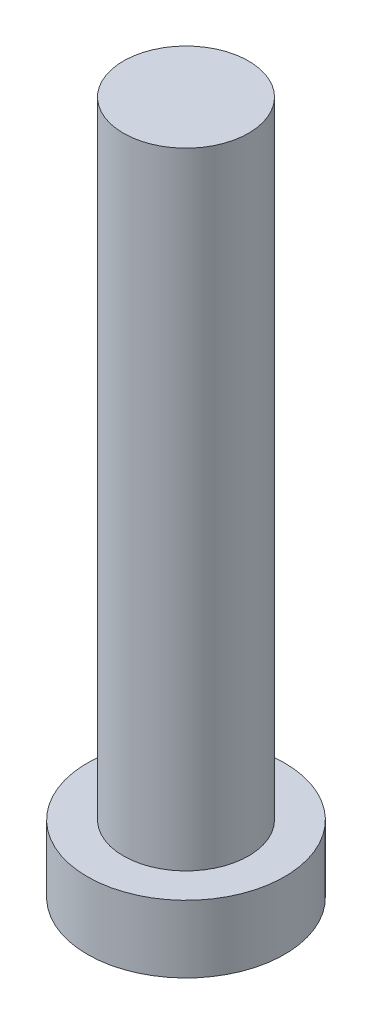
ISO-10303-21;
HEADER;
FILE_DESCRIPTION(('STEP AP214'),'2;1');
FILE_NAME('part.step','',(''),(''),'','','');
FILE_SCHEMA(('AUTOMOTIVE_DESIGN { 1 0 10303 214 1 1 1 1 }'));
ENDSEC;
DATA;
#1=APPLICATION_CONTEXT('core data for automotive mechanical design processes');
#2=APPLICATION_PROTOCOL_DEFINITION('international standard','automotive_design',2000,#1);
#3=PRODUCT_CONTEXT('',#1,'mechanical');
#4=PRODUCT('Part','Part','',(#3));
#5=PRODUCT_RELATED_PRODUCT_CATEGORY('part','',(#4));
#6=PRODUCT_DEFINITION_FORMATION('','',#4);
#7=PRODUCT_DEFINITION_CONTEXT('part definition',#1,'design');
#8=PRODUCT_DEFINITION('design','',#6,#7);
#9=PRODUCT_DEFINITION_SHAPE('','',#8);
#10=(LENGTH_UNIT() NAMED_UNIT(*) SI_UNIT(.MILLI.,.METRE.));
#11=(NAMED_UNIT(*) PLANE_ANGLE_UNIT() SI_UNIT($,.RADIAN.));
#12=(NAMED_UNIT(*) SI_UNIT($,.STERADIAN.) SOLID_ANGLE_UNIT());
#13=UNCERTAINTY_MEASURE_WITH_UNIT(LENGTH_MEASURE(1.E-05),#10,'distance_accuracy_value','');
#14=(GEOMETRIC_REPRESENTATION_CONTEXT(3) GLOBAL_UNCERTAINTY_ASSIGNED_CONTEXT((#13)) GLOBAL_UNIT_ASSIGNED_CONTEXT((#10,
#11,#12)) REPRESENTATION_CONTEXT('',''));
#15=CARTESIAN_POINT('',(0.,0.,0.));
#16=DIRECTION('',(0.,0.,1.));
#17=DIRECTION('',(1.,0.,0.));
#18=AXIS2_PLACEMENT_3D('',#15,#16,#17);
#19=CARTESIAN_POINT('',(0.,0.,0.));
#20=DIRECTION('',(0.,1.,0.));
#21=DIRECTION('',(0.,0.,1.));
#22=AXIS2_PLACEMENT_3D('',#19,#20,#21);
#23=PLANE('',#22);
#24=CARTESIAN_POINT('',(0.,0.,0.));
#25=DIRECTION('',(0.,1.,0.));
#26=DIRECTION('',(0.,0.,1.));
#27=AXIS2_PLACEMENT_3D('',#24,#25,#26);
#28=CIRCLE('',#27,3.15);
#29=CARTESIAN_POINT('',(0.,0.,3.15));
#30=VERTEX_POINT('',#29);
#31=EDGE_CURVE('E39',#30,#30,#28,.T.);
#32=ORIENTED_EDGE('',*,*,#31,.F.);
#33=EDGE_LOOP('',(#32));
#34=FACE_BOUND('',#33,.T.);
#35=CARTESIAN_POINT('',(1.,0.,1.));
#36=DIRECTION('',(0.,1.,0.));
#37=DIRECTION('',(0.,0.,-1.));
#38=AXIS2_PLACEMENT_3D('',#35,#36,#37);
#39=CIRCLE('',#38,0.5);
#40=CARTESIAN_POINT('',(1.,0.,0.5));
#41=VERTEX_POINT('',#40);
#42=CARTESIAN_POINT('',(0.5,0.,1.));
#43=VERTEX_POINT('',#42);
#44=EDGE_CURVE('E186',#41,#43,#39,.T.);
#45=ORIENTED_EDGE('',*,*,#44,.F.);
#46=DIRECTION('',(-1.,0.,0.));
#47=VECTOR('',#46,1.);
#48=CARTESIAN_POINT('',(1.,0.,0.5));
#49=LINE('',#48,#47);
#50=CARTESIAN_POINT('',(2.,0.,0.5));
#51=VERTEX_POINT('',#50);
#52=EDGE_CURVE('E52',#51,#41,#49,.T.);
#53=ORIENTED_EDGE('',*,*,#52,.F.);
#54=DIRECTION('',(0.,0.,1.));
#55=VECTOR('',#54,1.);
#56=CARTESIAN_POINT('',(2.,0.,-0.5));
#57=LINE('',#56,#55);
#58=CARTESIAN_POINT('',(2.,0.,-0.5));
#59=VERTEX_POINT('',#58);
#60=EDGE_CURVE('E225',#59,#51,#57,.T.);
#61=ORIENTED_EDGE('',*,*,#60,.F.);
#62=DIRECTION('',(1.,0.,0.));
#63=VECTOR('',#62,1.);
#64=CARTESIAN_POINT('',(1.,0.,-0.5));
#65=LINE('',#64,#63);
#66=CARTESIAN_POINT('',(1.,0.,-0.5));
#67=VERTEX_POINT('',#66);
#68=EDGE_CURVE('E223',#67,#59,#65,.T.);
#69=ORIENTED_EDGE('',*,*,#68,.F.);
#70=CARTESIAN_POINT('',(1.,0.,-1.));
#71=DIRECTION('',(0.,1.,0.));
#72=DIRECTION('',(0.,0.,-1.));
#73=AXIS2_PLACEMENT_3D('',#70,#71,#72);
#74=CIRCLE('',#73,0.5);
#75=CARTESIAN_POINT('',(0.500000000000001,0.,-1.));
#76=VERTEX_POINT('',#75);
#77=EDGE_CURVE('E160',#76,#67,#74,.T.);
#78=ORIENTED_EDGE('',*,*,#77,.F.);
#79=DIRECTION('',(0.,0.,1.));
#80=VECTOR('',#79,1.);
#81=CARTESIAN_POINT('',(0.500000000000001,0.,-2.));
#82=LINE('',#81,#80);
#83=CARTESIAN_POINT('',(0.500000000000001,0.,-2.));
#84=VERTEX_POINT('',#83);
#85=EDGE_CURVE('E219',#84,#76,#82,.T.);
#86=ORIENTED_EDGE('',*,*,#85,.F.);
#87=DIRECTION('',(1.,0.,0.));
#88=VECTOR('',#87,1.);
#89=CARTESIAN_POINT('',(-0.5,0.,-2.));
#90=LINE('',#89,#88);
#91=CARTESIAN_POINT('',(-0.5,0.,-2.));
#92=VERTEX_POINT('',#91);
#93=EDGE_CURVE('E216',#92,#84,#90,.T.);
#94=ORIENTED_EDGE('',*,*,#93,.F.);
#95=DIRECTION('',(0.,0.,-1.));
#96=VECTOR('',#95,1.);
#97=CARTESIAN_POINT('',(-0.5,0.,-2.));
#98=LINE('',#97,#96);
#99=CARTESIAN_POINT('',(-0.5,0.,-1.));
#100=VERTEX_POINT('',#99);
#101=EDGE_CURVE('E213',#100,#92,#98,.T.);
#102=ORIENTED_EDGE('',*,*,#101,.F.);
#103=CARTESIAN_POINT('',(-1.,0.,-1.));
#104=DIRECTION('',(0.,1.,0.));
#105=DIRECTION('',(0.,0.,-1.));
#106=AXIS2_PLACEMENT_3D('',#103,#104,#105);
#107=CIRCLE('',#106,0.5);
#108=CARTESIAN_POINT('',(-1.,0.,-0.5));
#109=VERTEX_POINT('',#108);
#110=EDGE_CURVE('E210',#109,#100,#107,.T.);
#111=ORIENTED_EDGE('',*,*,#110,.F.);
#112=DIRECTION('',(1.,0.,0.));
#113=VECTOR('',#112,1.);
#114=CARTESIAN_POINT('',(-2.,0.,-0.5));
#115=LINE('',#114,#113);
#116=CARTESIAN_POINT('',(-2.,0.,-0.5));
#117=VERTEX_POINT('',#116);
#118=EDGE_CURVE('E207',#117,#109,#115,.T.);
#119=ORIENTED_EDGE('',*,*,#118,.F.);
#120=DIRECTION('',(0.,0.,-1.));
#121=VECTOR('',#120,1.);
#122=CARTESIAN_POINT('',(-2.,0.,-0.5));
#123=LINE('',#122,#121);
#124=CARTESIAN_POINT('',(-2.,0.,0.5));
#125=VERTEX_POINT('',#124);
#126=EDGE_CURVE('E204',#125,#117,#123,.T.);
#127=ORIENTED_EDGE('',*,*,#126,.F.);
#128=DIRECTION('',(-1.,0.,0.));
#129=VECTOR('',#128,1.);
#130=CARTESIAN_POINT('',(-2.,0.,0.5));
#131=LINE('',#130,#129);
#132=CARTESIAN_POINT('',(-1.,0.,0.5));
#133=VERTEX_POINT('',#132);
#134=EDGE_CURVE('E201',#133,#125,#131,.T.);
#135=ORIENTED_EDGE('',*,*,#134,.F.);
#136=CARTESIAN_POINT('',(-1.,0.,1.));
#137=DIRECTION('',(0.,1.,0.));
#138=DIRECTION('',(0.,0.,1.));
#139=AXIS2_PLACEMENT_3D('',#136,#137,#138);
#140=CIRCLE('',#139,0.5);
#141=CARTESIAN_POINT('',(-0.5,0.,1.));
#142=VERTEX_POINT('',#141);
#143=EDGE_CURVE('E198',#142,#133,#140,.T.);
#144=ORIENTED_EDGE('',*,*,#143,.F.);
#145=DIRECTION('',(0.,0.,-1.));
#146=VECTOR('',#145,1.);
#147=CARTESIAN_POINT('',(-0.5,0.,1.));
#148=LINE('',#147,#146);
#149=CARTESIAN_POINT('',(-0.5,0.,2.));
#150=VERTEX_POINT('',#149);
#151=EDGE_CURVE('E195',#150,#142,#148,.T.);
#152=ORIENTED_EDGE('',*,*,#151,.F.);
#153=DIRECTION('',(-1.,0.,0.));
#154=VECTOR('',#153,1.);
#155=CARTESIAN_POINT('',(-0.5,0.,2.));
#156=LINE('',#155,#154);
#157=CARTESIAN_POINT('',(0.500000000000001,0.,2.));
#158=VERTEX_POINT('',#157);
#159=EDGE_CURVE('E192',#158,#150,#156,.T.);
#160=ORIENTED_EDGE('',*,*,#159,.F.);
#161=DIRECTION('',(0.,0.,1.));
#162=VECTOR('',#161,1.);
#163=CARTESIAN_POINT('',(0.5,0.,1.));
#164=LINE('',#163,#162);
#165=EDGE_CURVE('E189',#43,#158,#164,.T.);
#166=ORIENTED_EDGE('',*,*,#165,.F.);
#167=EDGE_LOOP('',(#45,#53,#61,#69,#78,#86,#94,#102,#111,#119,#127,#135,#144,#152,#160,#166));
#168=FACE_BOUND('',#167,.T.);
#169=ADVANCED_FACE('F35',(#34,#168),#23,.F.);
#170=CARTESIAN_POINT('',(0.,2.15,0.));
#171=DIRECTION('',(0.,-1.,0.));
#172=DIRECTION('',(0.,0.,-1.));
#173=AXIS2_PLACEMENT_3D('',#170,#171,#172);
#174=CYLINDRICAL_SURFACE('',#173,3.15);
#175=CARTESIAN_POINT('',(0.,2.15,0.));
#176=DIRECTION('',(0.,1.,0.));
#177=DIRECTION('',(0.,0.,1.));
#178=AXIS2_PLACEMENT_3D('',#175,#176,#177);
#179=CIRCLE('',#178,3.15);
#180=CARTESIAN_POINT('',(0.,2.15,3.15));
#181=VERTEX_POINT('',#180);
#182=EDGE_CURVE('E44',#181,#181,#179,.T.);
#183=ORIENTED_EDGE('',*,*,#182,.F.);
#184=EDGE_LOOP('',(#183));
#185=FACE_BOUND('',#184,.T.);
#186=ORIENTED_EDGE('',*,*,#31,.T.);
#187=EDGE_LOOP('',(#186));
#188=FACE_BOUND('',#187,.T.);
#189=ADVANCED_FACE('F37',(#185,#188),#174,.T.);
#190=CARTESIAN_POINT('',(0.,2.15,0.));
#191=DIRECTION('',(0.,1.,0.));
#192=DIRECTION('',(0.,0.,1.));
#193=AXIS2_PLACEMENT_3D('',#190,#191,#192);
#194=PLANE('',#193);
#195=CARTESIAN_POINT('',(0.,2.15,0.));
#196=DIRECTION('',(0.,1.,0.));
#197=DIRECTION('',(0.,0.,1.));
#198=AXIS2_PLACEMENT_3D('',#195,#196,#197);
#199=CIRCLE('',#198,2.);
#200=CARTESIAN_POINT('',(0.,2.15,2.));
#201=VERTEX_POINT('',#200);
#202=EDGE_CURVE('E11',#201,#201,#199,.T.);
#203=ORIENTED_EDGE('',*,*,#202,.F.);
#204=EDGE_LOOP('',(#203));
#205=FACE_BOUND('',#204,.T.);
#206=ORIENTED_EDGE('',*,*,#182,.T.);
#207=EDGE_LOOP('',(#206));
#208=FACE_BOUND('',#207,.T.);
#209=ADVANCED_FACE('F374',(#205,#208),#194,.T.);
#210=CARTESIAN_POINT('',(0.,22.15,0.));
#211=DIRECTION('',(0.,-1.,0.));
#212=DIRECTION('',(0.,0.,-1.));
#213=AXIS2_PLACEMENT_3D('',#210,#211,#212);
#214=CYLINDRICAL_SURFACE('',#213,2.);
#215=CARTESIAN_POINT('',(0.,22.15,0.));
#216=DIRECTION('',(0.,1.,0.));
#217=DIRECTION('',(0.,0.,1.));
#218=AXIS2_PLACEMENT_3D('',#215,#216,#217);
#219=CIRCLE('',#218,2.);
#220=CARTESIAN_POINT('',(0.,22.15,2.));
#221=VERTEX_POINT('',#220);
#222=EDGE_CURVE('E229',#221,#221,#219,.T.);
#223=ORIENTED_EDGE('',*,*,#222,.F.);
#224=EDGE_LOOP('',(#223));
#225=FACE_BOUND('',#224,.T.);
#226=ORIENTED_EDGE('',*,*,#202,.T.);
#227=EDGE_LOOP('',(#226));
#228=FACE_BOUND('',#227,.T.);
#229=ADVANCED_FACE('F370',(#225,#228),#214,.T.);
#230=CARTESIAN_POINT('',(0.,22.15,0.));
#231=DIRECTION('',(0.,1.,0.));
#232=DIRECTION('',(0.,0.,1.));
#233=AXIS2_PLACEMENT_3D('',#230,#231,#232);
#234=PLANE('',#233);
#235=ORIENTED_EDGE('',*,*,#222,.T.);
#236=EDGE_LOOP('',(#235));
#237=FACE_BOUND('',#236,.T.);
#238=ADVANCED_FACE('F320',(#237),#234,.T.);
#239=CARTESIAN_POINT('',(1.,1.5,0.5));
#240=DIRECTION('',(0.,0.,1.));
#241=DIRECTION('',(1.,0.,0.));
#242=AXIS2_PLACEMENT_3D('',#239,#240,#241);
#243=PLANE('',#242);
#244=ORIENTED_EDGE('',*,*,#52,.T.);
#245=DIRECTION('',(0.,-1.,0.));
#246=VECTOR('',#245,1.);
#247=CARTESIAN_POINT('',(1.,1.5,0.5));
#248=LINE('',#247,#246);
#249=CARTESIAN_POINT('',(1.,1.5,0.5));
#250=VERTEX_POINT('',#249);
#251=EDGE_CURVE('E112',#250,#41,#248,.T.);
#252=ORIENTED_EDGE('',*,*,#251,.F.);
#253=DIRECTION('',(-1.,0.,0.));
#254=VECTOR('',#253,1.);
#255=CARTESIAN_POINT('',(1.,1.5,0.5));
#256=LINE('',#255,#254);
#257=CARTESIAN_POINT('',(2.,1.5,0.5));
#258=VERTEX_POINT('',#257);
#259=EDGE_CURVE('E227',#258,#250,#256,.T.);
#260=ORIENTED_EDGE('',*,*,#259,.F.);
#261=DIRECTION('',(0.,-1.,0.));
#262=VECTOR('',#261,1.);
#263=CARTESIAN_POINT('',(2.,1.5,0.5));
#264=LINE('',#263,#262);
#265=EDGE_CURVE('E60',#258,#51,#264,.T.);
#266=ORIENTED_EDGE('',*,*,#265,.T.);
#267=EDGE_LOOP('',(#244,#252,#260,#266));
#268=FACE_BOUND('',#267,.T.);
#269=ADVANCED_FACE('F313',(#268),#243,.F.);
#270=CARTESIAN_POINT('',(2.,1.5,-0.5));
#271=DIRECTION('',(1.,0.,0.));
#272=DIRECTION('',(0.,0.,-1.));
#273=AXIS2_PLACEMENT_3D('',#270,#271,#272);
#274=PLANE('',#273);
#275=ORIENTED_EDGE('',*,*,#60,.T.);
#276=ORIENTED_EDGE('',*,*,#265,.F.);
#277=DIRECTION('',(0.,0.,1.));
#278=VECTOR('',#277,1.);
#279=CARTESIAN_POINT('',(2.,1.5,-0.5));
#280=LINE('',#279,#278);
#281=CARTESIAN_POINT('',(2.,1.5,-0.5));
#282=VERTEX_POINT('',#281);
#283=EDGE_CURVE('E172',#282,#258,#280,.T.);
#284=ORIENTED_EDGE('',*,*,#283,.F.);
#285=DIRECTION('',(0.,-1.,0.));
#286=VECTOR('',#285,1.);
#287=CARTESIAN_POINT('',(2.,1.5,-0.5));
#288=LINE('',#287,#286);
#289=EDGE_CURVE('E164',#282,#59,#288,.T.);
#290=ORIENTED_EDGE('',*,*,#289,.T.);
#291=EDGE_LOOP('',(#275,#276,#284,#290));
#292=FACE_BOUND('',#291,.T.);
#293=ADVANCED_FACE('F311',(#292),#274,.F.);
#294=CARTESIAN_POINT('',(1.,1.5,-0.5));
#295=DIRECTION('',(0.,0.,-1.));
#296=DIRECTION('',(-1.,0.,0.));
#297=AXIS2_PLACEMENT_3D('',#294,#295,#296);
#298=PLANE('',#297);
#299=ORIENTED_EDGE('',*,*,#68,.T.);
#300=ORIENTED_EDGE('',*,*,#289,.F.);
#301=DIRECTION('',(1.,0.,0.));
#302=VECTOR('',#301,1.);
#303=CARTESIAN_POINT('',(1.,1.5,-0.5));
#304=LINE('',#303,#302);
#305=CARTESIAN_POINT('',(1.,1.5,-0.5));
#306=VERTEX_POINT('',#305);
#307=EDGE_CURVE('E168',#306,#282,#304,.T.);
#308=ORIENTED_EDGE('',*,*,#307,.F.);
#309=DIRECTION('',(0.,-1.,0.));
#310=VECTOR('',#309,1.);
#311=CARTESIAN_POINT('',(1.,1.5,-0.5));
#312=LINE('',#311,#310);
#313=EDGE_CURVE('E153',#306,#67,#312,.T.);
#314=ORIENTED_EDGE('',*,*,#313,.T.);
#315=EDGE_LOOP('',(#299,#300,#308,#314));
#316=FACE_BOUND('',#315,.T.);
#317=ADVANCED_FACE('F169',(#316),#298,.F.);
#318=CARTESIAN_POINT('',(1.,1.5,-1.));
#319=DIRECTION('',(0.,-1.,0.));
#320=DIRECTION('',(0.,0.,-1.));
#321=AXIS2_PLACEMENT_3D('',#318,#319,#320);
#322=CYLINDRICAL_SURFACE('',#321,0.5);
#323=ORIENTED_EDGE('',*,*,#77,.T.);
#324=ORIENTED_EDGE('',*,*,#313,.F.);
#325=CARTESIAN_POINT('',(1.,1.5,-1.));
#326=DIRECTION('',(0.,1.,0.));
#327=DIRECTION('',(0.,0.,-1.));
#328=AXIS2_PLACEMENT_3D('',#325,#326,#327);
#329=CIRCLE('',#328,0.5);
#330=CARTESIAN_POINT('',(0.500000000000001,1.5,-1.));
#331=VERTEX_POINT('',#330);
#332=EDGE_CURVE('E157',#331,#306,#329,.T.);
#333=ORIENTED_EDGE('',*,*,#332,.F.);
#334=DIRECTION('',(0.,-1.,0.));
#335=VECTOR('',#334,1.);
#336=CARTESIAN_POINT('',(0.500000000000001,1.5,-1.));
#337=LINE('',#336,#335);
#338=EDGE_CURVE('E165',#331,#76,#337,.T.);
#339=ORIENTED_EDGE('',*,*,#338,.T.);
#340=EDGE_LOOP('',(#323,#324,#333,#339));
#341=FACE_BOUND('',#340,.T.);
#342=ADVANCED_FACE('F155',(#341),#322,.T.);
#343=CARTESIAN_POINT('',(0.500000000000001,1.5,-2.));
#344=DIRECTION('',(1.,0.,0.));
#345=DIRECTION('',(0.,0.,-1.));
#346=AXIS2_PLACEMENT_3D('',#343,#344,#345);
#347=PLANE('',#346);
#348=ORIENTED_EDGE('',*,*,#85,.T.);
#349=ORIENTED_EDGE('',*,*,#338,.F.);
#350=DIRECTION('',(0.,0.,1.));
#351=VECTOR('',#350,1.);
#352=CARTESIAN_POINT('',(0.500000000000001,1.5,-2.));
#353=LINE('',#352,#351);
#354=CARTESIAN_POINT('',(0.500000000000001,1.5,-2.));
#355=VERTEX_POINT('',#354);
#356=EDGE_CURVE('E178',#355,#331,#353,.T.);
#357=ORIENTED_EDGE('',*,*,#356,.F.);
#358=DIRECTION('',(0.,-1.,0.));
#359=VECTOR('',#358,1.);
#360=CARTESIAN_POINT('',(0.500000000000001,1.5,-2.));
#361=LINE('',#360,#359);
#362=EDGE_CURVE('E232',#355,#84,#361,.T.);
#363=ORIENTED_EDGE('',*,*,#362,.T.);
#364=EDGE_LOOP('',(#348,#349,#357,#363));
#365=FACE_BOUND('',#364,.T.);
#366=ADVANCED_FACE('F310',(#365),#347,.F.);
#367=CARTESIAN_POINT('',(-0.5,1.5,-2.));
#368=DIRECTION('',(0.,0.,-1.));
#369=DIRECTION('',(-1.,0.,0.));
#370=AXIS2_PLACEMENT_3D('',#367,#368,#369);
#371=PLANE('',#370);
#372=ORIENTED_EDGE('',*,*,#93,.T.);
#373=ORIENTED_EDGE('',*,*,#362,.F.);
#374=DIRECTION('',(1.,0.,0.));
#375=VECTOR('',#374,1.);
#376=CARTESIAN_POINT('',(-0.5,1.5,-2.));
#377=LINE('',#376,#375);
#378=CARTESIAN_POINT('',(-0.5,1.5,-2.));
#379=VERTEX_POINT('',#378);
#380=EDGE_CURVE('E180',#379,#355,#377,.T.);
#381=ORIENTED_EDGE('',*,*,#380,.F.);
#382=DIRECTION('',(0.,-1.,0.));
#383=VECTOR('',#382,1.);
#384=CARTESIAN_POINT('',(-0.5,1.5,-2.));
#385=LINE('',#384,#383);
#386=EDGE_CURVE('E234',#379,#92,#385,.T.);
#387=ORIENTED_EDGE('',*,*,#386,.T.);
#388=EDGE_LOOP('',(#372,#373,#381,#387));
#389=FACE_BOUND('',#388,.T.);
#390=ADVANCED_FACE('F306',(#389),#371,.F.);
#391=CARTESIAN_POINT('',(-0.5,1.5,-2.));
#392=DIRECTION('',(-1.,0.,0.));
#393=DIRECTION('',(0.,0.,1.));
#394=AXIS2_PLACEMENT_3D('',#391,#392,#393);
#395=PLANE('',#394);
#396=ORIENTED_EDGE('',*,*,#101,.T.);
#397=ORIENTED_EDGE('',*,*,#386,.F.);
#398=DIRECTION('',(0.,0.,-1.));
#399=VECTOR('',#398,1.);
#400=CARTESIAN_POINT('',(-0.5,1.5,-2.));
#401=LINE('',#400,#399);
#402=CARTESIAN_POINT('',(-0.5,1.5,-1.));
#403=VERTEX_POINT('',#402);
#404=EDGE_CURVE('E301',#403,#379,#401,.T.);
#405=ORIENTED_EDGE('',*,*,#404,.F.);
#406=DIRECTION('',(0.,-1.,0.));
#407=VECTOR('',#406,1.);
#408=CARTESIAN_POINT('',(-0.5,1.5,-1.));
#409=LINE('',#408,#407);
#410=EDGE_CURVE('E236',#403,#100,#409,.T.);
#411=ORIENTED_EDGE('',*,*,#410,.T.);
#412=EDGE_LOOP('',(#396,#397,#405,#411));
#413=FACE_BOUND('',#412,.T.);
#414=ADVANCED_FACE('F330',(#413),#395,.F.);
#415=CARTESIAN_POINT('',(-1.,1.5,-1.));
#416=DIRECTION('',(0.,-1.,0.));
#417=DIRECTION('',(0.,0.,-1.));
#418=AXIS2_PLACEMENT_3D('',#415,#416,#417);
#419=CYLINDRICAL_SURFACE('',#418,0.5);
#420=ORIENTED_EDGE('',*,*,#110,.T.);
#421=ORIENTED_EDGE('',*,*,#410,.F.);
#422=CARTESIAN_POINT('',(-1.,1.5,-1.));
#423=DIRECTION('',(0.,1.,0.));
#424=DIRECTION('',(0.,0.,-1.));
#425=AXIS2_PLACEMENT_3D('',#422,#423,#424);
#426=CIRCLE('',#425,0.5);
#427=CARTESIAN_POINT('',(-1.,1.5,-0.5));
#428=VERTEX_POINT('',#427);
#429=EDGE_CURVE('E298',#428,#403,#426,.T.);
#430=ORIENTED_EDGE('',*,*,#429,.F.);
#431=DIRECTION('',(0.,-1.,0.));
#432=VECTOR('',#431,1.);
#433=CARTESIAN_POINT('',(-1.,1.5,-0.5));
#434=LINE('',#433,#432);
#435=EDGE_CURVE('E238',#428,#109,#434,.T.);
#436=ORIENTED_EDGE('',*,*,#435,.T.);
#437=EDGE_LOOP('',(#420,#421,#430,#436));
#438=FACE_BOUND('',#437,.T.);
#439=ADVANCED_FACE('F333',(#438),#419,.T.);
#440=CARTESIAN_POINT('',(-2.,1.5,-0.5));
#441=DIRECTION('',(0.,0.,-1.));
#442=DIRECTION('',(-1.,0.,0.));
#443=AXIS2_PLACEMENT_3D('',#440,#441,#442);
#444=PLANE('',#443);
#445=ORIENTED_EDGE('',*,*,#118,.T.);
#446=ORIENTED_EDGE('',*,*,#435,.F.);
#447=DIRECTION('',(1.,0.,0.));
#448=VECTOR('',#447,1.);
#449=CARTESIAN_POINT('',(-2.,1.5,-0.5));
#450=LINE('',#449,#448);
#451=CARTESIAN_POINT('',(-2.,1.5,-0.5));
#452=VERTEX_POINT('',#451);
#453=EDGE_CURVE('E295',#452,#428,#450,.T.);
#454=ORIENTED_EDGE('',*,*,#453,.F.);
#455=DIRECTION('',(0.,-1.,0.));
#456=VECTOR('',#455,1.);
#457=CARTESIAN_POINT('',(-2.,1.5,-0.5));
#458=LINE('',#457,#456);
#459=EDGE_CURVE('E240',#452,#117,#458,.T.);
#460=ORIENTED_EDGE('',*,*,#459,.T.);
#461=EDGE_LOOP('',(#445,#446,#454,#460));
#462=FACE_BOUND('',#461,.T.);
#463=ADVANCED_FACE('F337',(#462),#444,.F.);
#464=CARTESIAN_POINT('',(-2.,1.5,-0.5));
#465=DIRECTION('',(-1.,0.,0.));
#466=DIRECTION('',(0.,0.,1.));
#467=AXIS2_PLACEMENT_3D('',#464,#465,#466);
#468=PLANE('',#467);
#469=ORIENTED_EDGE('',*,*,#126,.T.);
#470=ORIENTED_EDGE('',*,*,#459,.F.);
#471=DIRECTION('',(0.,0.,-1.));
#472=VECTOR('',#471,1.);
#473=CARTESIAN_POINT('',(-2.,1.5,-0.5));
#474=LINE('',#473,#472);
#475=CARTESIAN_POINT('',(-2.,1.5,0.5));
#476=VERTEX_POINT('',#475);
#477=EDGE_CURVE('E292',#476,#452,#474,.T.);
#478=ORIENTED_EDGE('',*,*,#477,.F.);
#479=DIRECTION('',(0.,-1.,0.));
#480=VECTOR('',#479,1.);
#481=CARTESIAN_POINT('',(-2.,1.5,0.5));
#482=LINE('',#481,#480);
#483=EDGE_CURVE('E242',#476,#125,#482,.T.);
#484=ORIENTED_EDGE('',*,*,#483,.T.);
#485=EDGE_LOOP('',(#469,#470,#478,#484));
#486=FACE_BOUND('',#485,.T.);
#487=ADVANCED_FACE('F341',(#486),#468,.F.);
#488=CARTESIAN_POINT('',(-2.,1.5,0.5));
#489=DIRECTION('',(0.,0.,1.));
#490=DIRECTION('',(1.,0.,0.));
#491=AXIS2_PLACEMENT_3D('',#488,#489,#490);
#492=PLANE('',#491);
#493=ORIENTED_EDGE('',*,*,#134,.T.);
#494=ORIENTED_EDGE('',*,*,#483,.F.);
#495=DIRECTION('',(-1.,0.,0.));
#496=VECTOR('',#495,1.);
#497=CARTESIAN_POINT('',(-2.,1.5,0.5));
#498=LINE('',#497,#496);
#499=CARTESIAN_POINT('',(-1.,1.5,0.5));
#500=VERTEX_POINT('',#499);
#501=EDGE_CURVE('E289',#500,#476,#498,.T.);
#502=ORIENTED_EDGE('',*,*,#501,.F.);
#503=DIRECTION('',(0.,-1.,0.));
#504=VECTOR('',#503,1.);
#505=CARTESIAN_POINT('',(-1.,1.5,0.5));
#506=LINE('',#505,#504);
#507=EDGE_CURVE('E244',#500,#133,#506,.T.);
#508=ORIENTED_EDGE('',*,*,#507,.T.);
#509=EDGE_LOOP('',(#493,#494,#502,#508));
#510=FACE_BOUND('',#509,.T.);
#511=ADVANCED_FACE('F345',(#510),#492,.F.);
#512=CARTESIAN_POINT('',(-1.,1.5,1.));
#513=DIRECTION('',(0.,-1.,0.));
#514=DIRECTION('',(0.,0.,-1.));
#515=AXIS2_PLACEMENT_3D('',#512,#513,#514);
#516=CYLINDRICAL_SURFACE('',#515,0.5);
#517=ORIENTED_EDGE('',*,*,#143,.T.);
#518=ORIENTED_EDGE('',*,*,#507,.F.);
#519=CARTESIAN_POINT('',(-1.,1.5,1.));
#520=DIRECTION('',(0.,1.,0.));
#521=DIRECTION('',(0.,0.,1.));
#522=AXIS2_PLACEMENT_3D('',#519,#520,#521);
#523=CIRCLE('',#522,0.5);
#524=CARTESIAN_POINT('',(-0.5,1.5,1.));
#525=VERTEX_POINT('',#524);
#526=EDGE_CURVE('E286',#525,#500,#523,.T.);
#527=ORIENTED_EDGE('',*,*,#526,.F.);
#528=DIRECTION('',(0.,-1.,0.));
#529=VECTOR('',#528,1.);
#530=CARTESIAN_POINT('',(-0.5,1.5,1.));
#531=LINE('',#530,#529);
#532=EDGE_CURVE('E246',#525,#142,#531,.T.);
#533=ORIENTED_EDGE('',*,*,#532,.T.);
#534=EDGE_LOOP('',(#517,#518,#527,#533));
#535=FACE_BOUND('',#534,.T.);
#536=ADVANCED_FACE('F349',(#535),#516,.T.);
#537=CARTESIAN_POINT('',(-0.5,1.5,1.));
#538=DIRECTION('',(-1.,0.,0.));
#539=DIRECTION('',(0.,0.,1.));
#540=AXIS2_PLACEMENT_3D('',#537,#538,#539);
#541=PLANE('',#540);
#542=ORIENTED_EDGE('',*,*,#151,.T.);
#543=ORIENTED_EDGE('',*,*,#532,.F.);
#544=DIRECTION('',(0.,0.,-1.));
#545=VECTOR('',#544,1.);
#546=CARTESIAN_POINT('',(-0.5,1.5,1.));
#547=LINE('',#546,#545);
#548=CARTESIAN_POINT('',(-0.5,1.5,2.));
#549=VERTEX_POINT('',#548);
#550=EDGE_CURVE('E283',#549,#525,#547,.T.);
#551=ORIENTED_EDGE('',*,*,#550,.F.);
#552=DIRECTION('',(0.,-1.,0.));
#553=VECTOR('',#552,1.);
#554=CARTESIAN_POINT('',(-0.5,1.5,2.));
#555=LINE('',#554,#553);
#556=EDGE_CURVE('E248',#549,#150,#555,.T.);
#557=ORIENTED_EDGE('',*,*,#556,.T.);
#558=EDGE_LOOP('',(#542,#543,#551,#557));
#559=FACE_BOUND('',#558,.T.);
#560=ADVANCED_FACE('F353',(#559),#541,.F.);
#561=CARTESIAN_POINT('',(-0.5,1.5,2.));
#562=DIRECTION('',(0.,0.,1.));
#563=DIRECTION('',(1.,0.,0.));
#564=AXIS2_PLACEMENT_3D('',#561,#562,#563);
#565=PLANE('',#564);
#566=ORIENTED_EDGE('',*,*,#159,.T.);
#567=ORIENTED_EDGE('',*,*,#556,.F.);
#568=DIRECTION('',(-1.,0.,0.));
#569=VECTOR('',#568,1.);
#570=CARTESIAN_POINT('',(-0.5,1.5,2.));
#571=LINE('',#570,#569);
#572=CARTESIAN_POINT('',(0.500000000000001,1.5,2.));
#573=VERTEX_POINT('',#572);
#574=EDGE_CURVE('E280',#573,#549,#571,.T.);
#575=ORIENTED_EDGE('',*,*,#574,.F.);
#576=DIRECTION('',(0.,-1.,0.));
#577=VECTOR('',#576,1.);
#578=CARTESIAN_POINT('',(0.500000000000001,1.5,2.));
#579=LINE('',#578,#577);
#580=EDGE_CURVE('E250',#573,#158,#579,.T.);
#581=ORIENTED_EDGE('',*,*,#580,.T.);
#582=EDGE_LOOP('',(#566,#567,#575,#581));
#583=FACE_BOUND('',#582,.T.);
#584=ADVANCED_FACE('F357',(#583),#565,.F.);
#585=CARTESIAN_POINT('',(0.5,1.5,1.));
#586=DIRECTION('',(1.,0.,0.));
#587=DIRECTION('',(0.,0.,-1.));
#588=AXIS2_PLACEMENT_3D('',#585,#586,#587);
#589=PLANE('',#588);
#590=ORIENTED_EDGE('',*,*,#165,.T.);
#591=ORIENTED_EDGE('',*,*,#580,.F.);
#592=DIRECTION('',(0.,0.,1.));
#593=VECTOR('',#592,1.);
#594=CARTESIAN_POINT('',(0.5,1.5,1.));
#595=LINE('',#594,#593);
#596=CARTESIAN_POINT('',(0.5,1.5,1.));
#597=VERTEX_POINT('',#596);
#598=EDGE_CURVE('E275',#597,#573,#595,.T.);
#599=ORIENTED_EDGE('',*,*,#598,.F.);
#600=DIRECTION('',(0.,-1.,0.));
#601=VECTOR('',#600,1.);
#602=CARTESIAN_POINT('',(0.5,1.5,1.));
#603=LINE('',#602,#601);
#604=EDGE_CURVE('E252',#597,#43,#603,.T.);
#605=ORIENTED_EDGE('',*,*,#604,.T.);
#606=EDGE_LOOP('',(#590,#591,#599,#605));
#607=FACE_BOUND('',#606,.T.);
#608=ADVANCED_FACE('F361',(#607),#589,.F.);
#609=CARTESIAN_POINT('',(1.,1.5,1.));
#610=DIRECTION('',(0.,-1.,0.));
#611=DIRECTION('',(0.,0.,-1.));
#612=AXIS2_PLACEMENT_3D('',#609,#610,#611);
#613=CYLINDRICAL_SURFACE('',#612,0.5);
#614=ORIENTED_EDGE('',*,*,#44,.T.);
#615=ORIENTED_EDGE('',*,*,#604,.F.);
#616=CARTESIAN_POINT('',(1.,1.5,1.));
#617=DIRECTION('',(0.,1.,0.));
#618=DIRECTION('',(0.,0.,-1.));
#619=AXIS2_PLACEMENT_3D('',#616,#617,#618);
#620=CIRCLE('',#619,0.5);
#621=EDGE_CURVE('E273',#250,#597,#620,.T.);
#622=ORIENTED_EDGE('',*,*,#621,.F.);
#623=ORIENTED_EDGE('',*,*,#251,.T.);
#624=EDGE_LOOP('',(#614,#615,#622,#623));
#625=FACE_BOUND('',#624,.T.);
#626=ADVANCED_FACE('F270',(#625),#613,.T.);
#627=CARTESIAN_POINT('',(1.,1.5,-1.));
#628=DIRECTION('',(0.,-1.,0.));
#629=DIRECTION('',(0.,0.,-1.));
#630=AXIS2_PLACEMENT_3D('',#627,#628,#629);
#631=PLANE('',#630);
#632=ORIENTED_EDGE('',*,*,#259,.T.);
#633=ORIENTED_EDGE('',*,*,#621,.T.);
#634=ORIENTED_EDGE('',*,*,#598,.T.);
#635=ORIENTED_EDGE('',*,*,#574,.T.);
#636=ORIENTED_EDGE('',*,*,#550,.T.);
#637=ORIENTED_EDGE('',*,*,#526,.T.);
#638=ORIENTED_EDGE('',*,*,#501,.T.);
#639=ORIENTED_EDGE('',*,*,#477,.T.);
#640=ORIENTED_EDGE('',*,*,#453,.T.);
#641=ORIENTED_EDGE('',*,*,#429,.T.);
#642=ORIENTED_EDGE('',*,*,#404,.T.);
#643=ORIENTED_EDGE('',*,*,#380,.T.);
#644=ORIENTED_EDGE('',*,*,#356,.T.);
#645=ORIENTED_EDGE('',*,*,#332,.T.);
#646=ORIENTED_EDGE('',*,*,#307,.T.);
#647=ORIENTED_EDGE('',*,*,#283,.T.);
#648=EDGE_LOOP('',(#632,#633,#634,#635,#636,#637,#638,#639,#640,#641,#642,#643,#644,#645,#646,#647));
#649=FACE_BOUND('',#648,.T.);
#650=ADVANCED_FACE('F175',(#649),#631,.T.);
#651=CLOSED_SHELL('',(#169,#189,#209,#229,#238,#269,#293,#317,#342,#366,#390,#414,#439,#463,
#487,#511,#536,#560,#584,#608,#626,#650));
#652=MANIFOLD_SOLID_BREP('B2',#651);
#653=ADVANCED_BREP_SHAPE_REPRESENTATION('',(#18,#652),#14);
#654=SHAPE_DEFINITION_REPRESENTATION(#9,#653);
ENDSEC;
END-ISO-10303-21;
